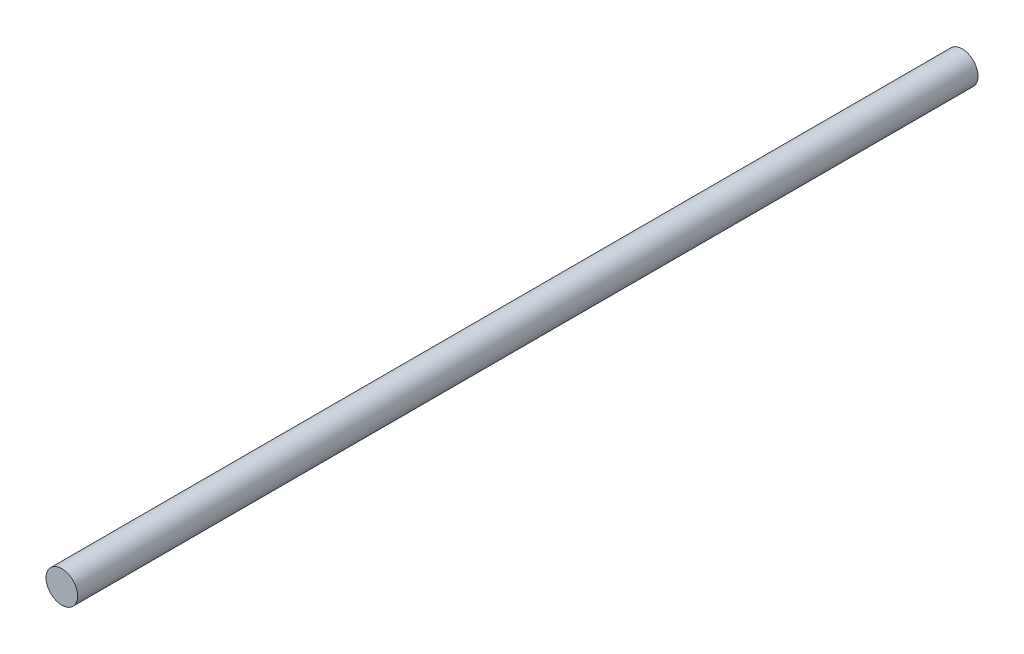
ISO-10303-21;
HEADER;
FILE_DESCRIPTION(('STEP AP214'),'2;1');
FILE_NAME('part.step','',(''),(''),'','','');
FILE_SCHEMA(('AUTOMOTIVE_DESIGN { 1 0 10303 214 1 1 1 1 }'));
ENDSEC;
DATA;
#1=APPLICATION_CONTEXT('core data for automotive mechanical design processes');
#2=APPLICATION_PROTOCOL_DEFINITION('international standard','automotive_design',2000,#1);
#3=PRODUCT_CONTEXT('',#1,'mechanical');
#4=PRODUCT('Part','Part','',(#3));
#5=PRODUCT_RELATED_PRODUCT_CATEGORY('part','',(#4));
#6=PRODUCT_DEFINITION_FORMATION('','',#4);
#7=PRODUCT_DEFINITION_CONTEXT('part definition',#1,'design');
#8=PRODUCT_DEFINITION('design','',#6,#7);
#9=PRODUCT_DEFINITION_SHAPE('','',#8);
#10=(LENGTH_UNIT() NAMED_UNIT(*) SI_UNIT(.MILLI.,.METRE.));
#11=(NAMED_UNIT(*) PLANE_ANGLE_UNIT() SI_UNIT($,.RADIAN.));
#12=(NAMED_UNIT(*) SI_UNIT($,.STERADIAN.) SOLID_ANGLE_UNIT());
#13=UNCERTAINTY_MEASURE_WITH_UNIT(LENGTH_MEASURE(1.E-05),#10,'distance_accuracy_value','');
#14=(GEOMETRIC_REPRESENTATION_CONTEXT(3) GLOBAL_UNCERTAINTY_ASSIGNED_CONTEXT((#13)) GLOBAL_UNIT_ASSIGNED_CONTEXT((#10,
#11,#12)) REPRESENTATION_CONTEXT('',''));
#15=CARTESIAN_POINT('',(0.,0.,0.));
#16=DIRECTION('',(0.,0.,1.));
#17=DIRECTION('',(1.,0.,0.));
#18=AXIS2_PLACEMENT_3D('',#15,#16,#17);
#19=CARTESIAN_POINT('',(0.,0.,287.5));
#20=DIRECTION('',(0.,0.,-1.));
#21=DIRECTION('',(-1.,0.,0.));
#22=AXIS2_PLACEMENT_3D('',#19,#20,#21);
#23=CYLINDRICAL_SURFACE('',#22,4.);
#24=CARTESIAN_POINT('',(0.,0.,332.5));
#25=DIRECTION('',(0.,0.,1.));
#26=DIRECTION('',(1.,0.,0.));
#27=AXIS2_PLACEMENT_3D('',#24,#25,#26);
#28=CIRCLE('',#27,4.);
#29=CARTESIAN_POINT('',(4.,0.,332.5));
#30=VERTEX_POINT('',#29);
#31=EDGE_CURVE('E10',#30,#30,#28,.T.);
#32=ORIENTED_EDGE('',*,*,#31,.F.);
#33=EDGE_LOOP('',(#32));
#34=FACE_BOUND('',#33,.T.);
#35=CARTESIAN_POINT('',(0.,0.,105.));
#36=DIRECTION('',(0.,0.,-1.));
#37=DIRECTION('',(-1.,0.,0.));
#38=AXIS2_PLACEMENT_3D('',#35,#36,#37);
#39=CIRCLE('',#38,4.);
#40=CARTESIAN_POINT('',(-4.,0.,105.));
#41=VERTEX_POINT('',#40);
#42=EDGE_CURVE('E43',#41,#41,#39,.T.);
#43=ORIENTED_EDGE('',*,*,#42,.F.);
#44=EDGE_LOOP('',(#43));
#45=FACE_BOUND('',#44,.T.);
#46=ADVANCED_FACE('F37',(#34,#45),#23,.T.);
#47=CARTESIAN_POINT('',(0.,0.,332.5));
#48=DIRECTION('',(0.,0.,1.));
#49=DIRECTION('',(1.,0.,0.));
#50=AXIS2_PLACEMENT_3D('',#47,#48,#49);
#51=PLANE('',#50);
#52=ORIENTED_EDGE('',*,*,#31,.T.);
#53=EDGE_LOOP('',(#52));
#54=FACE_BOUND('',#53,.T.);
#55=ADVANCED_FACE('F52',(#54),#51,.T.);
#56=CARTESIAN_POINT('',(0.,0.,105.));
#57=DIRECTION('',(0.,0.,-1.));
#58=DIRECTION('',(-1.,0.,0.));
#59=AXIS2_PLACEMENT_3D('',#56,#57,#58);
#60=PLANE('',#59);
#61=ORIENTED_EDGE('',*,*,#42,.T.);
#62=EDGE_LOOP('',(#61));
#63=FACE_BOUND('',#62,.T.);
#64=ADVANCED_FACE('F49',(#63),#60,.T.);
#65=CLOSED_SHELL('',(#46,#55,#64));
#66=MANIFOLD_SOLID_BREP('B2',#65);
#67=ADVANCED_BREP_SHAPE_REPRESENTATION('',(#18,#66),#14);
#68=SHAPE_DEFINITION_REPRESENTATION(#9,#67);
ENDSEC;
END-ISO-10303-21;
